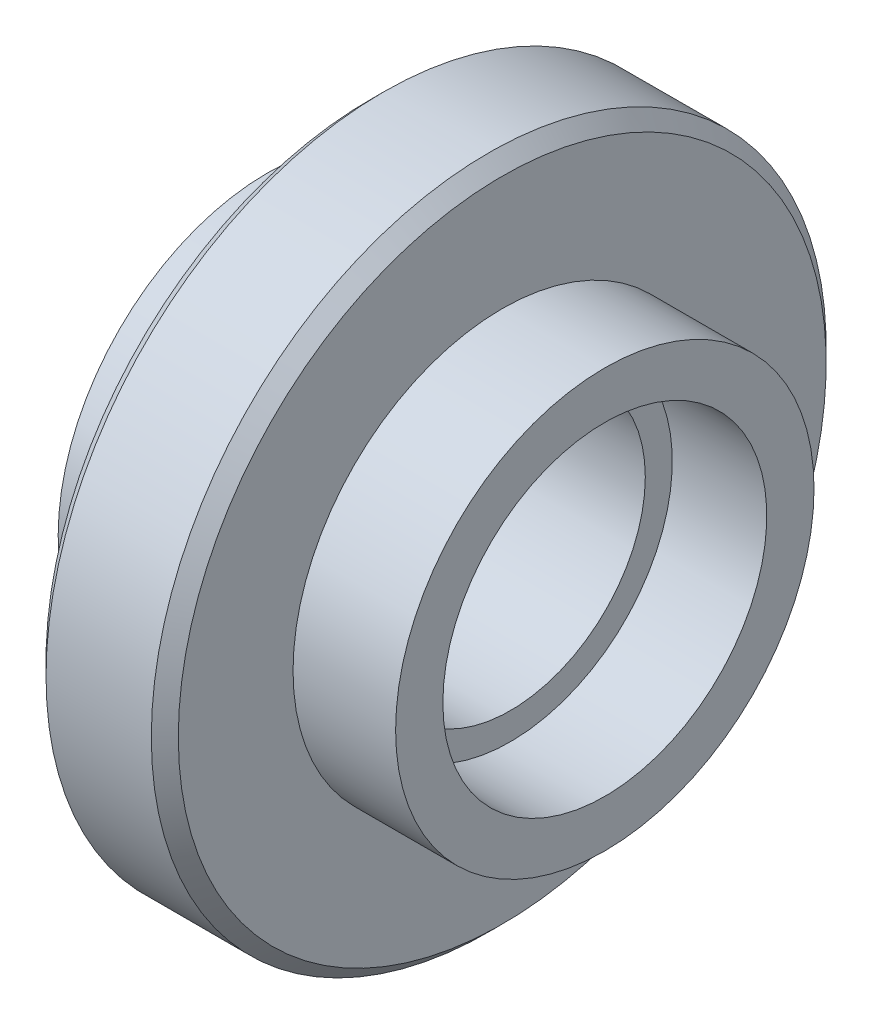
ISO-10303-21;
HEADER;
FILE_DESCRIPTION(('STEP AP214'),'2;1');
FILE_NAME('part.step','',(''),(''),'','','');
FILE_SCHEMA(('AUTOMOTIVE_DESIGN { 1 0 10303 214 1 1 1 1 }'));
ENDSEC;
DATA;
#1=APPLICATION_CONTEXT('core data for automotive mechanical design processes');
#2=APPLICATION_PROTOCOL_DEFINITION('international standard','automotive_design',2000,#1);
#3=PRODUCT_CONTEXT('',#1,'mechanical');
#4=PRODUCT('Part','Part','',(#3));
#5=PRODUCT_RELATED_PRODUCT_CATEGORY('part','',(#4));
#6=PRODUCT_DEFINITION_FORMATION('','',#4);
#7=PRODUCT_DEFINITION_CONTEXT('part definition',#1,'design');
#8=PRODUCT_DEFINITION('design','',#6,#7);
#9=PRODUCT_DEFINITION_SHAPE('','',#8);
#10=(LENGTH_UNIT() NAMED_UNIT(*) SI_UNIT(.MILLI.,.METRE.));
#11=(NAMED_UNIT(*) PLANE_ANGLE_UNIT() SI_UNIT($,.RADIAN.));
#12=(NAMED_UNIT(*) SI_UNIT($,.STERADIAN.) SOLID_ANGLE_UNIT());
#13=UNCERTAINTY_MEASURE_WITH_UNIT(LENGTH_MEASURE(1.E-05),#10,'distance_accuracy_value','');
#14=(GEOMETRIC_REPRESENTATION_CONTEXT(3) GLOBAL_UNCERTAINTY_ASSIGNED_CONTEXT((#13)) GLOBAL_UNIT_ASSIGNED_CONTEXT((#10,
#11,#12)) REPRESENTATION_CONTEXT('',''));
#15=CARTESIAN_POINT('',(0.,0.,0.));
#16=DIRECTION('',(0.,0.,1.));
#17=DIRECTION('',(1.,0.,0.));
#18=AXIS2_PLACEMENT_3D('',#15,#16,#17);
#19=CARTESIAN_POINT('',(-24.6188482893835,0.,0.));
#20=DIRECTION('',(-1.,0.,0.));
#21=DIRECTION('',(0.,0.,1.));
#22=AXIS2_PLACEMENT_3D('',#19,#20,#21);
#23=CYLINDRICAL_SURFACE('',#22,25.);
#24=CARTESIAN_POINT('',(-3.89999999999999,0.,0.));
#25=DIRECTION('',(1.,0.,0.));
#26=DIRECTION('',(0.,0.,-1.));
#27=AXIS2_PLACEMENT_3D('',#24,#25,#26);
#28=CIRCLE('',#27,25.);
#29=CARTESIAN_POINT('',(-3.89999999999999,0.,-25.));
#30=VERTEX_POINT('',#29);
#31=EDGE_CURVE('E41',#30,#30,#28,.T.);
#32=ORIENTED_EDGE('',*,*,#31,.T.);
#33=EDGE_LOOP('',(#32));
#34=FACE_BOUND('',#33,.T.);
#35=CARTESIAN_POINT('',(3.9,0.,0.));
#36=DIRECTION('',(-1.,0.,0.));
#37=DIRECTION('',(0.,0.,1.));
#38=AXIS2_PLACEMENT_3D('',#35,#36,#37);
#39=CIRCLE('',#38,25.);
#40=CARTESIAN_POINT('',(3.9,0.,25.));
#41=VERTEX_POINT('',#40);
#42=EDGE_CURVE('E45',#41,#41,#39,.T.);
#43=ORIENTED_EDGE('',*,*,#42,.T.);
#44=EDGE_LOOP('',(#43));
#45=FACE_BOUND('',#44,.T.);
#46=ADVANCED_FACE('F34',(#34,#45),#23,.T.);
#47=CARTESIAN_POINT('',(-4.9,15.5,0.));
#48=DIRECTION('',(1.,0.,0.));
#49=DIRECTION('',(0.,0.,-1.));
#50=AXIS2_PLACEMENT_3D('',#47,#48,#49);
#51=PLANE('',#50);
#52=CARTESIAN_POINT('',(-4.9,0.,0.));
#53=DIRECTION('',(1.,0.,0.));
#54=DIRECTION('',(0.,0.,-1.));
#55=AXIS2_PLACEMENT_3D('',#52,#53,#54);
#56=CIRCLE('',#55,24.);
#57=CARTESIAN_POINT('',(-4.9,0.,-24.));
#58=VERTEX_POINT('',#57);
#59=EDGE_CURVE('E49',#58,#58,#56,.F.);
#60=ORIENTED_EDGE('',*,*,#59,.T.);
#61=EDGE_LOOP('',(#60));
#62=FACE_BOUND('',#61,.T.);
#63=CARTESIAN_POINT('',(-4.9,0.,0.));
#64=DIRECTION('',(-1.,0.,0.));
#65=DIRECTION('',(0.,0.,1.));
#66=AXIS2_PLACEMENT_3D('',#63,#64,#65);
#67=CIRCLE('',#66,15.5);
#68=CARTESIAN_POINT('',(-4.9,0.,15.5));
#69=VERTEX_POINT('',#68);
#70=EDGE_CURVE('E54',#69,#69,#67,.T.);
#71=ORIENTED_EDGE('',*,*,#70,.F.);
#72=EDGE_LOOP('',(#71));
#73=FACE_BOUND('',#72,.T.);
#74=ADVANCED_FACE('F138',(#62,#73),#51,.F.);
#75=CARTESIAN_POINT('',(-24.6188482893835,0.,0.));
#76=DIRECTION('',(-1.,0.,0.));
#77=DIRECTION('',(0.,0.,1.));
#78=AXIS2_PLACEMENT_3D('',#75,#76,#77);
#79=CYLINDRICAL_SURFACE('',#78,15.5);
#80=CARTESIAN_POINT('',(-12.5,0.,0.));
#81=DIRECTION('',(-1.,0.,0.));
#82=DIRECTION('',(0.,0.,1.));
#83=AXIS2_PLACEMENT_3D('',#80,#81,#82);
#84=CIRCLE('',#83,15.5);
#85=CARTESIAN_POINT('',(-12.5,0.,15.5));
#86=VERTEX_POINT('',#85);
#87=EDGE_CURVE('E57',#86,#86,#84,.T.);
#88=ORIENTED_EDGE('',*,*,#87,.F.);
#89=EDGE_LOOP('',(#88));
#90=FACE_BOUND('',#89,.T.);
#91=ORIENTED_EDGE('',*,*,#70,.T.);
#92=EDGE_LOOP('',(#91));
#93=FACE_BOUND('',#92,.T.);
#94=ADVANCED_FACE('F132',(#90,#93),#79,.T.);
#95=CARTESIAN_POINT('',(-12.5,12.,0.));
#96=DIRECTION('',(1.,0.,0.));
#97=DIRECTION('',(0.,0.,-1.));
#98=AXIS2_PLACEMENT_3D('',#95,#96,#97);
#99=PLANE('',#98);
#100=CARTESIAN_POINT('',(-12.5,0.,0.));
#101=DIRECTION('',(-1.,0.,0.));
#102=DIRECTION('',(0.,0.,1.));
#103=AXIS2_PLACEMENT_3D('',#100,#101,#102);
#104=CIRCLE('',#103,12.);
#105=CARTESIAN_POINT('',(-12.5,0.,12.));
#106=VERTEX_POINT('',#105);
#107=EDGE_CURVE('E60',#106,#106,#104,.T.);
#108=ORIENTED_EDGE('',*,*,#107,.F.);
#109=EDGE_LOOP('',(#108));
#110=FACE_BOUND('',#109,.T.);
#111=ORIENTED_EDGE('',*,*,#87,.T.);
#112=EDGE_LOOP('',(#111));
#113=FACE_BOUND('',#112,.T.);
#114=ADVANCED_FACE('F126',(#110,#113),#99,.F.);
#115=CARTESIAN_POINT('',(-24.6188482893835,0.,0.));
#116=DIRECTION('',(-1.,0.,0.));
#117=DIRECTION('',(0.,0.,1.));
#118=AXIS2_PLACEMENT_3D('',#115,#116,#117);
#119=CYLINDRICAL_SURFACE('',#118,12.);
#120=CARTESIAN_POINT('',(-5.5,0.,0.));
#121=DIRECTION('',(-1.,0.,0.));
#122=DIRECTION('',(0.,0.,1.));
#123=AXIS2_PLACEMENT_3D('',#120,#121,#122);
#124=CIRCLE('',#123,12.);
#125=CARTESIAN_POINT('',(-5.5,0.,12.));
#126=VERTEX_POINT('',#125);
#127=EDGE_CURVE('E63',#126,#126,#124,.T.);
#128=ORIENTED_EDGE('',*,*,#127,.F.);
#129=EDGE_LOOP('',(#128));
#130=FACE_BOUND('',#129,.T.);
#131=ORIENTED_EDGE('',*,*,#107,.T.);
#132=EDGE_LOOP('',(#131));
#133=FACE_BOUND('',#132,.T.);
#134=ADVANCED_FACE('F120',(#130,#133),#119,.F.);
#135=CARTESIAN_POINT('',(-5.5,10.,0.));
#136=DIRECTION('',(1.,0.,0.));
#137=DIRECTION('',(0.,0.,-1.));
#138=AXIS2_PLACEMENT_3D('',#135,#136,#137);
#139=PLANE('',#138);
#140=CARTESIAN_POINT('',(-5.5,0.,0.));
#141=DIRECTION('',(-1.,0.,0.));
#142=DIRECTION('',(0.,0.,1.));
#143=AXIS2_PLACEMENT_3D('',#140,#141,#142);
#144=CIRCLE('',#143,10.);
#145=CARTESIAN_POINT('',(-5.5,0.,10.));
#146=VERTEX_POINT('',#145);
#147=EDGE_CURVE('E66',#146,#146,#144,.T.);
#148=ORIENTED_EDGE('',*,*,#147,.F.);
#149=EDGE_LOOP('',(#148));
#150=FACE_BOUND('',#149,.T.);
#151=ORIENTED_EDGE('',*,*,#127,.T.);
#152=EDGE_LOOP('',(#151));
#153=FACE_BOUND('',#152,.T.);
#154=ADVANCED_FACE('F114',(#150,#153),#139,.F.);
#155=CARTESIAN_POINT('',(-24.6188482893835,0.,0.));
#156=DIRECTION('',(-1.,0.,0.));
#157=DIRECTION('',(0.,0.,1.));
#158=AXIS2_PLACEMENT_3D('',#155,#156,#157);
#159=CYLINDRICAL_SURFACE('',#158,10.);
#160=CARTESIAN_POINT('',(5.5,0.,0.));
#161=DIRECTION('',(-1.,0.,0.));
#162=DIRECTION('',(0.,0.,1.));
#163=AXIS2_PLACEMENT_3D('',#160,#161,#162);
#164=CIRCLE('',#163,10.);
#165=CARTESIAN_POINT('',(5.5,0.,10.));
#166=VERTEX_POINT('',#165);
#167=EDGE_CURVE('E69',#166,#166,#164,.T.);
#168=ORIENTED_EDGE('',*,*,#167,.F.);
#169=EDGE_LOOP('',(#168));
#170=FACE_BOUND('',#169,.T.);
#171=ORIENTED_EDGE('',*,*,#147,.T.);
#172=EDGE_LOOP('',(#171));
#173=FACE_BOUND('',#172,.T.);
#174=ADVANCED_FACE('F108',(#170,#173),#159,.F.);
#175=CARTESIAN_POINT('',(5.5,10.,0.));
#176=DIRECTION('',(-1.,0.,0.));
#177=DIRECTION('',(0.,0.,1.));
#178=AXIS2_PLACEMENT_3D('',#175,#176,#177);
#179=PLANE('',#178);
#180=CARTESIAN_POINT('',(5.5,0.,0.));
#181=DIRECTION('',(-1.,0.,0.));
#182=DIRECTION('',(0.,0.,1.));
#183=AXIS2_PLACEMENT_3D('',#180,#181,#182);
#184=CIRCLE('',#183,12.);
#185=CARTESIAN_POINT('',(5.5,0.,12.));
#186=VERTEX_POINT('',#185);
#187=EDGE_CURVE('E72',#186,#186,#184,.T.);
#188=ORIENTED_EDGE('',*,*,#187,.F.);
#189=EDGE_LOOP('',(#188));
#190=FACE_BOUND('',#189,.T.);
#191=ORIENTED_EDGE('',*,*,#167,.T.);
#192=EDGE_LOOP('',(#191));
#193=FACE_BOUND('',#192,.T.);
#194=ADVANCED_FACE('F102',(#190,#193),#179,.F.);
#195=CARTESIAN_POINT('',(-24.6188482893835,0.,0.));
#196=DIRECTION('',(-1.,0.,0.));
#197=DIRECTION('',(0.,0.,1.));
#198=AXIS2_PLACEMENT_3D('',#195,#196,#197);
#199=CYLINDRICAL_SURFACE('',#198,12.);
#200=CARTESIAN_POINT('',(12.5,0.,0.));
#201=DIRECTION('',(-1.,0.,0.));
#202=DIRECTION('',(0.,0.,1.));
#203=AXIS2_PLACEMENT_3D('',#200,#201,#202);
#204=CIRCLE('',#203,12.);
#205=CARTESIAN_POINT('',(12.5,0.,12.));
#206=VERTEX_POINT('',#205);
#207=EDGE_CURVE('E75',#206,#206,#204,.T.);
#208=ORIENTED_EDGE('',*,*,#207,.F.);
#209=EDGE_LOOP('',(#208));
#210=FACE_BOUND('',#209,.T.);
#211=ORIENTED_EDGE('',*,*,#187,.T.);
#212=EDGE_LOOP('',(#211));
#213=FACE_BOUND('',#212,.T.);
#214=ADVANCED_FACE('F96',(#210,#213),#199,.F.);
#215=CARTESIAN_POINT('',(12.5,12.,0.));
#216=DIRECTION('',(-1.,0.,0.));
#217=DIRECTION('',(0.,0.,1.));
#218=AXIS2_PLACEMENT_3D('',#215,#216,#217);
#219=PLANE('',#218);
#220=CARTESIAN_POINT('',(12.5,0.,0.));
#221=DIRECTION('',(-1.,0.,0.));
#222=DIRECTION('',(0.,0.,1.));
#223=AXIS2_PLACEMENT_3D('',#220,#221,#222);
#224=CIRCLE('',#223,15.5);
#225=CARTESIAN_POINT('',(12.5,0.,15.5));
#226=VERTEX_POINT('',#225);
#227=EDGE_CURVE('E78',#226,#226,#224,.T.);
#228=ORIENTED_EDGE('',*,*,#227,.F.);
#229=EDGE_LOOP('',(#228));
#230=FACE_BOUND('',#229,.T.);
#231=ORIENTED_EDGE('',*,*,#207,.T.);
#232=EDGE_LOOP('',(#231));
#233=FACE_BOUND('',#232,.T.);
#234=ADVANCED_FACE('F90',(#230,#233),#219,.F.);
#235=CARTESIAN_POINT('',(-24.6188482893835,0.,0.));
#236=DIRECTION('',(-1.,0.,0.));
#237=DIRECTION('',(0.,0.,1.));
#238=AXIS2_PLACEMENT_3D('',#235,#236,#237);
#239=CYLINDRICAL_SURFACE('',#238,15.5);
#240=CARTESIAN_POINT('',(4.9,0.,0.));
#241=DIRECTION('',(-1.,0.,0.));
#242=DIRECTION('',(0.,0.,1.));
#243=AXIS2_PLACEMENT_3D('',#240,#241,#242);
#244=CIRCLE('',#243,15.5);
#245=CARTESIAN_POINT('',(4.9,0.,15.5));
#246=VERTEX_POINT('',#245);
#247=EDGE_CURVE('E81',#246,#246,#244,.T.);
#248=ORIENTED_EDGE('',*,*,#247,.F.);
#249=EDGE_LOOP('',(#248));
#250=FACE_BOUND('',#249,.T.);
#251=ORIENTED_EDGE('',*,*,#227,.T.);
#252=EDGE_LOOP('',(#251));
#253=FACE_BOUND('',#252,.T.);
#254=ADVANCED_FACE('F87',(#250,#253),#239,.T.);
#255=CARTESIAN_POINT('',(4.9,15.5,0.));
#256=DIRECTION('',(-1.,0.,0.));
#257=DIRECTION('',(0.,0.,1.));
#258=AXIS2_PLACEMENT_3D('',#255,#256,#257);
#259=PLANE('',#258);
#260=CARTESIAN_POINT('',(4.9,0.,0.));
#261=DIRECTION('',(-1.,0.,0.));
#262=DIRECTION('',(0.,0.,1.));
#263=AXIS2_PLACEMENT_3D('',#260,#261,#262);
#264=CIRCLE('',#263,24.);
#265=CARTESIAN_POINT('',(4.9,0.,24.));
#266=VERTEX_POINT('',#265);
#267=EDGE_CURVE('E10',#266,#266,#264,.F.);
#268=ORIENTED_EDGE('',*,*,#267,.T.);
#269=EDGE_LOOP('',(#268));
#270=FACE_BOUND('',#269,.T.);
#271=ORIENTED_EDGE('',*,*,#247,.T.);
#272=EDGE_LOOP('',(#271));
#273=FACE_BOUND('',#272,.T.);
#274=ADVANCED_FACE('F85',(#270,#273),#259,.F.);
#275=CARTESIAN_POINT('',(-4.9,0.,0.));
#276=DIRECTION('',(1.,0.,0.));
#277=DIRECTION('',(0.,0.,-1.));
#278=AXIS2_PLACEMENT_3D('',#275,#276,#277);
#279=CONICAL_SURFACE('',#278,24.,0.78539816339745);
#280=ORIENTED_EDGE('',*,*,#31,.F.);
#281=EDGE_LOOP('',(#280));
#282=FACE_BOUND('',#281,.T.);
#283=ORIENTED_EDGE('',*,*,#59,.F.);
#284=EDGE_LOOP('',(#283));
#285=FACE_BOUND('',#284,.T.);
#286=ADVANCED_FACE('F149',(#282,#285),#279,.T.);
#287=CARTESIAN_POINT('',(3.9,0.,0.));
#288=DIRECTION('',(-1.,0.,0.));
#289=DIRECTION('',(0.,0.,1.));
#290=AXIS2_PLACEMENT_3D('',#287,#288,#289);
#291=CONICAL_SURFACE('',#290,25.,0.785398163397452);
#292=ORIENTED_EDGE('',*,*,#267,.F.);
#293=EDGE_LOOP('',(#292));
#294=FACE_BOUND('',#293,.T.);
#295=ORIENTED_EDGE('',*,*,#42,.F.);
#296=EDGE_LOOP('',(#295));
#297=FACE_BOUND('',#296,.T.);
#298=ADVANCED_FACE('F36',(#294,#297),#291,.T.);
#299=CLOSED_SHELL('',(#46,#74,#94,#114,#134,#154,#174,#194,#214,#234,#254,#274,#286,#298));
#300=MANIFOLD_SOLID_BREP('B2',#299);
#301=ADVANCED_BREP_SHAPE_REPRESENTATION('',(#18,#300),#14);
#302=SHAPE_DEFINITION_REPRESENTATION(#9,#301);
ENDSEC;
END-ISO-10303-21;
